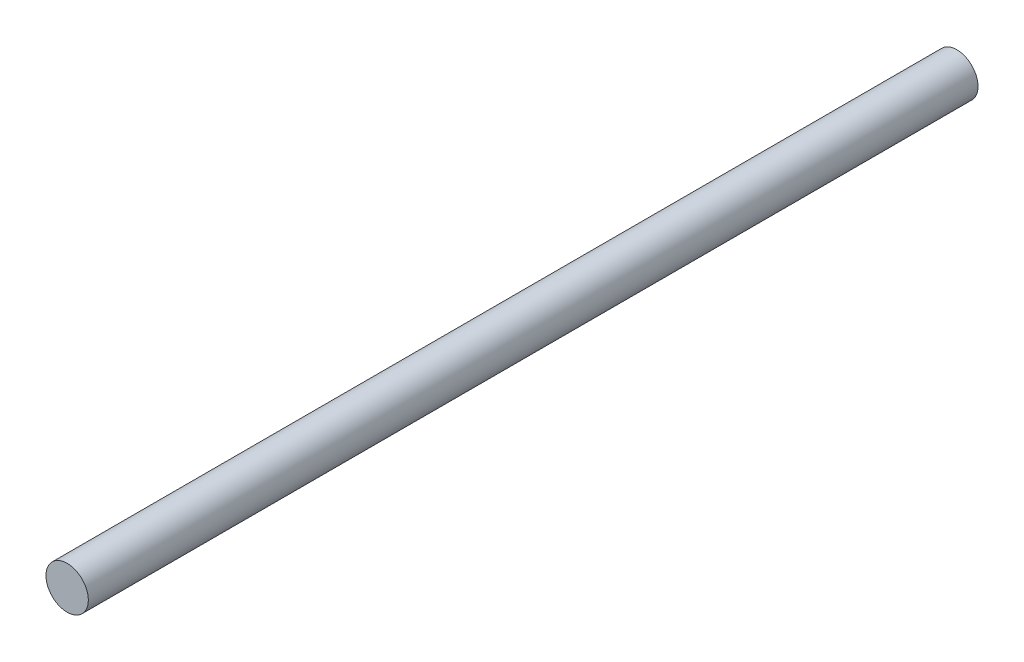
ISO-10303-21;
HEADER;
FILE_DESCRIPTION(('STEP AP214'),'2;1');
FILE_NAME('part.step','',(''),(''),'','','');
FILE_SCHEMA(('AUTOMOTIVE_DESIGN { 1 0 10303 214 1 1 1 1 }'));
ENDSEC;
DATA;
#1=APPLICATION_CONTEXT('core data for automotive mechanical design processes');
#2=APPLICATION_PROTOCOL_DEFINITION('international standard','automotive_design',2000,#1);
#3=PRODUCT_CONTEXT('',#1,'mechanical');
#4=PRODUCT('Part','Part','',(#3));
#5=PRODUCT_RELATED_PRODUCT_CATEGORY('part','',(#4));
#6=PRODUCT_DEFINITION_FORMATION('','',#4);
#7=PRODUCT_DEFINITION_CONTEXT('part definition',#1,'design');
#8=PRODUCT_DEFINITION('design','',#6,#7);
#9=PRODUCT_DEFINITION_SHAPE('','',#8);
#10=(LENGTH_UNIT() NAMED_UNIT(*) SI_UNIT(.MILLI.,.METRE.));
#11=(NAMED_UNIT(*) PLANE_ANGLE_UNIT() SI_UNIT($,.RADIAN.));
#12=(NAMED_UNIT(*) SI_UNIT($,.STERADIAN.) SOLID_ANGLE_UNIT());
#13=UNCERTAINTY_MEASURE_WITH_UNIT(LENGTH_MEASURE(1.E-05),#10,'distance_accuracy_value','');
#14=(GEOMETRIC_REPRESENTATION_CONTEXT(3) GLOBAL_UNCERTAINTY_ASSIGNED_CONTEXT((#13)) GLOBAL_UNIT_ASSIGNED_CONTEXT((#10,
#11,#12)) REPRESENTATION_CONTEXT('',''));
#15=CARTESIAN_POINT('',(0.,0.,0.));
#16=DIRECTION('',(0.,0.,1.));
#17=DIRECTION('',(1.,0.,0.));
#18=AXIS2_PLACEMENT_3D('',#15,#16,#17);
#19=CARTESIAN_POINT('',(0.,0.,63.));
#20=DIRECTION('',(0.,0.,-1.));
#21=DIRECTION('',(-1.,0.,0.));
#22=AXIS2_PLACEMENT_3D('',#19,#20,#21);
#23=CYLINDRICAL_SURFACE('',#22,1.5);
#24=CARTESIAN_POINT('',(0.,0.,63.));
#25=DIRECTION('',(0.,0.,1.));
#26=DIRECTION('',(1.,0.,0.));
#27=AXIS2_PLACEMENT_3D('',#24,#25,#26);
#28=CIRCLE('',#27,1.5);
#29=CARTESIAN_POINT('',(1.5,0.,63.));
#30=VERTEX_POINT('',#29);
#31=EDGE_CURVE('E10',#30,#30,#28,.T.);
#32=ORIENTED_EDGE('',*,*,#31,.F.);
#33=EDGE_LOOP('',(#32));
#34=FACE_BOUND('',#33,.T.);
#35=CARTESIAN_POINT('',(0.,0.,0.));
#36=DIRECTION('',(0.,0.,1.));
#37=DIRECTION('',(1.,0.,0.));
#38=AXIS2_PLACEMENT_3D('',#35,#36,#37);
#39=CIRCLE('',#38,1.5);
#40=CARTESIAN_POINT('',(1.5,0.,0.));
#41=VERTEX_POINT('',#40);
#42=EDGE_CURVE('E34',#41,#41,#39,.T.);
#43=ORIENTED_EDGE('',*,*,#42,.T.);
#44=EDGE_LOOP('',(#43));
#45=FACE_BOUND('',#44,.T.);
#46=ADVANCED_FACE('F31',(#34,#45),#23,.T.);
#47=CARTESIAN_POINT('',(0.,0.,63.));
#48=DIRECTION('',(0.,0.,1.));
#49=DIRECTION('',(1.,0.,0.));
#50=AXIS2_PLACEMENT_3D('',#47,#48,#49);
#51=PLANE('',#50);
#52=ORIENTED_EDGE('',*,*,#31,.T.);
#53=EDGE_LOOP('',(#52));
#54=FACE_BOUND('',#53,.T.);
#55=ADVANCED_FACE('F46',(#54),#51,.T.);
#56=CARTESIAN_POINT('',(0.,0.,0.));
#57=DIRECTION('',(0.,0.,1.));
#58=DIRECTION('',(1.,0.,0.));
#59=AXIS2_PLACEMENT_3D('',#56,#57,#58);
#60=PLANE('',#59);
#61=ORIENTED_EDGE('',*,*,#42,.F.);
#62=EDGE_LOOP('',(#61));
#63=FACE_BOUND('',#62,.T.);
#64=ADVANCED_FACE('F44',(#63),#60,.F.);
#65=CLOSED_SHELL('',(#46,#55,#64));
#66=MANIFOLD_SOLID_BREP('B2',#65);
#67=ADVANCED_BREP_SHAPE_REPRESENTATION('',(#18,#66),#14);
#68=SHAPE_DEFINITION_REPRESENTATION(#9,#67);
ENDSEC;
END-ISO-10303-21;
